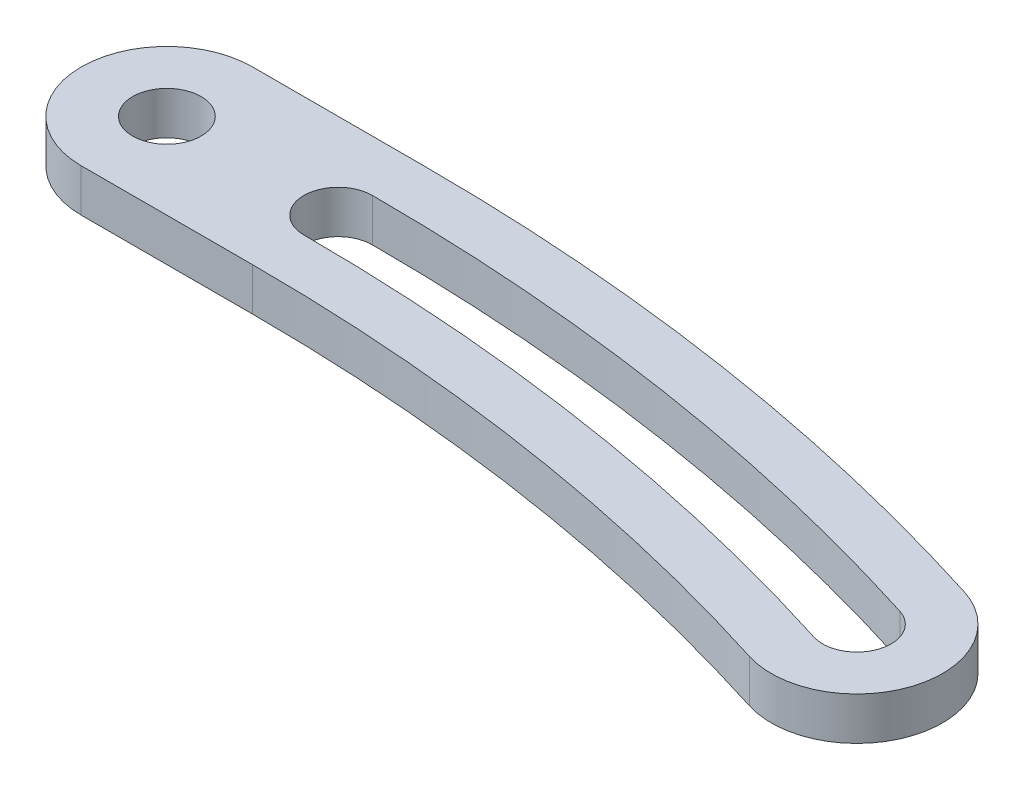
ISO-10303-21;
HEADER;
FILE_DESCRIPTION(('STEP AP214'),'2;1');
FILE_NAME('part.step','',(''),(''),'','','');
FILE_SCHEMA(('AUTOMOTIVE_DESIGN { 1 0 10303 214 1 1 1 1 }'));
ENDSEC;
DATA;
#1=APPLICATION_CONTEXT('core data for automotive mechanical design processes');
#2=APPLICATION_PROTOCOL_DEFINITION('international standard','automotive_design',2000,#1);
#3=PRODUCT_CONTEXT('',#1,'mechanical');
#4=PRODUCT('Part','Part','',(#3));
#5=PRODUCT_RELATED_PRODUCT_CATEGORY('part','',(#4));
#6=PRODUCT_DEFINITION_FORMATION('','',#4);
#7=PRODUCT_DEFINITION_CONTEXT('part definition',#1,'design');
#8=PRODUCT_DEFINITION('design','',#6,#7);
#9=PRODUCT_DEFINITION_SHAPE('','',#8);
#10=(LENGTH_UNIT() NAMED_UNIT(*) SI_UNIT(.MILLI.,.METRE.));
#11=(NAMED_UNIT(*) PLANE_ANGLE_UNIT() SI_UNIT($,.RADIAN.));
#12=(NAMED_UNIT(*) SI_UNIT($,.STERADIAN.) SOLID_ANGLE_UNIT());
#13=UNCERTAINTY_MEASURE_WITH_UNIT(LENGTH_MEASURE(1.E-05),#10,'distance_accuracy_value','');
#14=(GEOMETRIC_REPRESENTATION_CONTEXT(3) GLOBAL_UNCERTAINTY_ASSIGNED_CONTEXT((#13)) GLOBAL_UNIT_ASSIGNED_CONTEXT((#10,
#11,#12)) REPRESENTATION_CONTEXT('',''));
#15=CARTESIAN_POINT('',(0.,0.,0.));
#16=DIRECTION('',(0.,0.,1.));
#17=DIRECTION('',(1.,0.,0.));
#18=AXIS2_PLACEMENT_3D('',#15,#16,#17);
#19=CARTESIAN_POINT('',(3.02848265840421E-13,2.,95.));
#20=DIRECTION('',(0.,1.,0.));
#21=DIRECTION('',(0.,0.,1.));
#22=AXIS2_PLACEMENT_3D('',#19,#20,#21);
#23=PLANE('',#22);
#24=CARTESIAN_POINT('',(3.02848265840421E-13,2.,95.));
#25=DIRECTION('',(0.,1.,0.));
#26=DIRECTION('',(0.,0.,1.));
#27=AXIS2_PLACEMENT_3D('',#24,#25,#26);
#28=CIRCLE('',#27,96.6);
#29=CARTESIAN_POINT('',(29.1429098930937,2.,2.90086426592787));
#30=VERTEX_POINT('',#29);
#31=CARTESIAN_POINT('',(0.,2.,-1.60000000000002));
#32=VERTEX_POINT('',#31);
#33=EDGE_CURVE('E121',#30,#32,#28,.T.);
#34=ORIENTED_EDGE('',*,*,#33,.F.);
#35=CARTESIAN_POINT('',(28.660211592587,2.,4.42631578947359));
#36=DIRECTION('',(0.,1.,0.));
#37=DIRECTION('',(0.,0.,1.));
#38=AXIS2_PLACEMENT_3D('',#35,#36,#37);
#39=CIRCLE('',#38,1.60000000000001);
#40=CARTESIAN_POINT('',(28.1775132920802,2.,5.95176731301932));
#41=VERTEX_POINT('',#40);
#42=EDGE_CURVE('E113',#41,#30,#39,.T.);
#43=ORIENTED_EDGE('',*,*,#42,.F.);
#44=CARTESIAN_POINT('',(3.02848265840421E-13,2.,95.));
#45=DIRECTION('',(0.,-1.,0.));
#46=DIRECTION('',(0.,0.,1.));
#47=AXIS2_PLACEMENT_3D('',#44,#45,#46);
#48=CIRCLE('',#47,93.4);
#49=CARTESIAN_POINT('',(0.,2.,1.60000000000002));
#50=VERTEX_POINT('',#49);
#51=EDGE_CURVE('E136',#50,#41,#48,.T.);
#52=ORIENTED_EDGE('',*,*,#51,.F.);
#53=CARTESIAN_POINT('',(0.,2.,0.));
#54=DIRECTION('',(0.,1.,0.));
#55=DIRECTION('',(0.,0.,1.));
#56=AXIS2_PLACEMENT_3D('',#53,#54,#55);
#57=CIRCLE('',#56,1.60000000000001);
#58=EDGE_CURVE('E134',#32,#50,#57,.T.);
#59=ORIENTED_EDGE('',*,*,#58,.F.);
#60=EDGE_LOOP('',(#34,#43,#52,#59));
#61=FACE_BOUND('',#60,.T.);
#62=CARTESIAN_POINT('',(3.02848265840421E-13,2.,95.));
#63=DIRECTION('',(0.,-1.,0.));
#64=DIRECTION('',(0.,0.,1.));
#65=AXIS2_PLACEMENT_3D('',#62,#63,#64);
#66=CIRCLE('',#65,91.);
#67=CARTESIAN_POINT('',(0.,2.,4.00000000000002));
#68=VERTEX_POINT('',#67);
#69=CARTESIAN_POINT('',(27.4534658413202,2.,8.23994459833787));
#70=VERTEX_POINT('',#69);
#71=EDGE_CURVE('E152',#68,#70,#66,.T.);
#72=ORIENTED_EDGE('',*,*,#71,.T.);
#73=CARTESIAN_POINT('',(28.660211592587,2.,4.42631578947359));
#74=DIRECTION('',(0.,1.,0.));
#75=DIRECTION('',(0.,0.,1.));
#76=AXIS2_PLACEMENT_3D('',#73,#74,#75);
#77=CIRCLE('',#76,4.00000000000001);
#78=CARTESIAN_POINT('',(29.8669573438538,2.,0.612686980609317));
#79=VERTEX_POINT('',#78);
#80=EDGE_CURVE('E155',#70,#79,#77,.T.);
#81=ORIENTED_EDGE('',*,*,#80,.T.);
#82=CARTESIAN_POINT('',(3.02848265840421E-13,2.,95.));
#83=DIRECTION('',(0.,1.,0.));
#84=DIRECTION('',(0.,0.,-1.));
#85=AXIS2_PLACEMENT_3D('',#82,#83,#84);
#86=CIRCLE('',#85,99.);
#87=CARTESIAN_POINT('',(2.78443446685012E-13,2.,-4.00000000000002));
#88=VERTEX_POINT('',#87);
#89=EDGE_CURVE('E158',#79,#88,#86,.T.);
#90=ORIENTED_EDGE('',*,*,#89,.T.);
#91=DIRECTION('',(-1.,0.,0.));
#92=VECTOR('',#91,1.);
#93=CARTESIAN_POINT('',(-8.,2.,-4.00000000000001));
#94=LINE('',#93,#92);
#95=CARTESIAN_POINT('',(-8.,2.,-4.00000000000001));
#96=VERTEX_POINT('',#95);
#97=EDGE_CURVE('E160',#88,#96,#94,.T.);
#98=ORIENTED_EDGE('',*,*,#97,.T.);
#99=CARTESIAN_POINT('',(-8.,2.,0.));
#100=DIRECTION('',(0.,1.,0.));
#101=DIRECTION('',(0.,0.,1.));
#102=AXIS2_PLACEMENT_3D('',#99,#100,#101);
#103=CIRCLE('',#102,4.00000000000001);
#104=CARTESIAN_POINT('',(-8.,2.,4.));
#105=VERTEX_POINT('',#104);
#106=EDGE_CURVE('E162',#96,#105,#103,.T.);
#107=ORIENTED_EDGE('',*,*,#106,.T.);
#108=DIRECTION('',(1.,0.,0.));
#109=VECTOR('',#108,1.);
#110=CARTESIAN_POINT('',(-8.,2.,4.));
#111=LINE('',#110,#109);
#112=EDGE_CURVE('E164',#105,#68,#111,.T.);
#113=ORIENTED_EDGE('',*,*,#112,.T.);
#114=EDGE_LOOP('',(#72,#81,#90,#98,#107,#113));
#115=FACE_BOUND('',#114,.T.);
#116=CARTESIAN_POINT('',(-8.,2.,0.));
#117=DIRECTION('',(0.,1.,0.));
#118=DIRECTION('',(0.,0.,1.));
#119=AXIS2_PLACEMENT_3D('',#116,#117,#118);
#120=CIRCLE('',#119,1.59999999999999);
#121=CARTESIAN_POINT('',(-8.,2.,1.6));
#122=VERTEX_POINT('',#121);
#123=EDGE_CURVE('E142',#122,#122,#120,.T.);
#124=ORIENTED_EDGE('',*,*,#123,.F.);
#125=EDGE_LOOP('',(#124));
#126=FACE_BOUND('',#125,.T.);
#127=ADVANCED_FACE('F36',(#61,#115,#126),#23,.T.);
#128=CARTESIAN_POINT('',(3.02848265840421E-13,0.,95.));
#129=DIRECTION('',(0.,1.,0.));
#130=DIRECTION('',(0.,0.,1.));
#131=AXIS2_PLACEMENT_3D('',#128,#129,#130);
#132=PLANE('',#131);
#133=CARTESIAN_POINT('',(3.02848265840421E-13,0.,95.));
#134=DIRECTION('',(0.,-1.,0.));
#135=DIRECTION('',(0.,0.,1.));
#136=AXIS2_PLACEMENT_3D('',#133,#134,#135);
#137=CIRCLE('',#136,91.);
#138=CARTESIAN_POINT('',(0.,0.,4.00000000000002));
#139=VERTEX_POINT('',#138);
#140=CARTESIAN_POINT('',(27.4534658413202,0.,8.23994459833787));
#141=VERTEX_POINT('',#140);
#142=EDGE_CURVE('E129',#139,#141,#137,.T.);
#143=ORIENTED_EDGE('',*,*,#142,.F.);
#144=DIRECTION('',(1.,0.,0.));
#145=VECTOR('',#144,1.);
#146=CARTESIAN_POINT('',(-8.,0.,4.));
#147=LINE('',#146,#145);
#148=CARTESIAN_POINT('',(-8.,0.,4.));
#149=VERTEX_POINT('',#148);
#150=EDGE_CURVE('E156',#149,#139,#147,.T.);
#151=ORIENTED_EDGE('',*,*,#150,.F.);
#152=CARTESIAN_POINT('',(-8.,0.,0.));
#153=DIRECTION('',(0.,1.,0.));
#154=DIRECTION('',(0.,0.,1.));
#155=AXIS2_PLACEMENT_3D('',#152,#153,#154);
#156=CIRCLE('',#155,4.00000000000001);
#157=CARTESIAN_POINT('',(-8.,0.,-4.00000000000001));
#158=VERTEX_POINT('',#157);
#159=EDGE_CURVE('E175',#158,#149,#156,.T.);
#160=ORIENTED_EDGE('',*,*,#159,.F.);
#161=DIRECTION('',(-1.,0.,0.));
#162=VECTOR('',#161,1.);
#163=CARTESIAN_POINT('',(-8.,0.,-4.00000000000001));
#164=LINE('',#163,#162);
#165=CARTESIAN_POINT('',(2.78443446685012E-13,0.,-4.00000000000002));
#166=VERTEX_POINT('',#165);
#167=EDGE_CURVE('E173',#166,#158,#164,.T.);
#168=ORIENTED_EDGE('',*,*,#167,.F.);
#169=CARTESIAN_POINT('',(3.02848265840421E-13,0.,95.));
#170=DIRECTION('',(0.,1.,0.));
#171=DIRECTION('',(0.,0.,-1.));
#172=AXIS2_PLACEMENT_3D('',#169,#170,#171);
#173=CIRCLE('',#172,99.);
#174=CARTESIAN_POINT('',(29.8669573438538,0.,0.612686980609317));
#175=VERTEX_POINT('',#174);
#176=EDGE_CURVE('E171',#175,#166,#173,.T.);
#177=ORIENTED_EDGE('',*,*,#176,.F.);
#178=CARTESIAN_POINT('',(28.660211592587,0.,4.42631578947359));
#179=DIRECTION('',(0.,1.,0.));
#180=DIRECTION('',(0.,0.,1.));
#181=AXIS2_PLACEMENT_3D('',#178,#179,#180);
#182=CIRCLE('',#181,4.00000000000001);
#183=EDGE_CURVE('E169',#141,#175,#182,.T.);
#184=ORIENTED_EDGE('',*,*,#183,.F.);
#185=EDGE_LOOP('',(#143,#151,#160,#168,#177,#184));
#186=FACE_BOUND('',#185,.T.);
#187=CARTESIAN_POINT('',(28.660211592587,0.,4.42631578947359));
#188=DIRECTION('',(0.,1.,0.));
#189=DIRECTION('',(0.,0.,1.));
#190=AXIS2_PLACEMENT_3D('',#187,#188,#189);
#191=CIRCLE('',#190,1.60000000000001);
#192=CARTESIAN_POINT('',(28.1775132920803,0.,5.95176731301932));
#193=VERTEX_POINT('',#192);
#194=CARTESIAN_POINT('',(29.1429098930937,0.,2.90086426592787));
#195=VERTEX_POINT('',#194);
#196=EDGE_CURVE('E59',#193,#195,#191,.T.);
#197=ORIENTED_EDGE('',*,*,#196,.T.);
#198=CARTESIAN_POINT('',(3.02848265840421E-13,0.,95.));
#199=DIRECTION('',(0.,1.,0.));
#200=DIRECTION('',(0.,0.,1.));
#201=AXIS2_PLACEMENT_3D('',#198,#199,#200);
#202=CIRCLE('',#201,96.6);
#203=CARTESIAN_POINT('',(0.,0.,-1.60000000000002));
#204=VERTEX_POINT('',#203);
#205=EDGE_CURVE('E128',#195,#204,#202,.T.);
#206=ORIENTED_EDGE('',*,*,#205,.T.);
#207=CARTESIAN_POINT('',(0.,0.,0.));
#208=DIRECTION('',(0.,1.,0.));
#209=DIRECTION('',(0.,0.,1.));
#210=AXIS2_PLACEMENT_3D('',#207,#208,#209);
#211=CIRCLE('',#210,1.60000000000001);
#212=CARTESIAN_POINT('',(0.,0.,1.60000000000001));
#213=VERTEX_POINT('',#212);
#214=EDGE_CURVE('E144',#204,#213,#211,.T.);
#215=ORIENTED_EDGE('',*,*,#214,.T.);
#216=CARTESIAN_POINT('',(3.02848265840421E-13,0.,95.));
#217=DIRECTION('',(0.,-1.,0.));
#218=DIRECTION('',(0.,0.,1.));
#219=AXIS2_PLACEMENT_3D('',#216,#217,#218);
#220=CIRCLE('',#219,93.4);
#221=EDGE_CURVE('E122',#213,#193,#220,.T.);
#222=ORIENTED_EDGE('',*,*,#221,.T.);
#223=EDGE_LOOP('',(#197,#206,#215,#222));
#224=FACE_BOUND('',#223,.T.);
#225=CARTESIAN_POINT('',(-8.,0.,0.));
#226=DIRECTION('',(0.,1.,0.));
#227=DIRECTION('',(0.,0.,1.));
#228=AXIS2_PLACEMENT_3D('',#225,#226,#227);
#229=CIRCLE('',#228,1.59999999999999);
#230=CARTESIAN_POINT('',(-8.,0.,1.6));
#231=VERTEX_POINT('',#230);
#232=EDGE_CURVE('E254',#231,#231,#229,.T.);
#233=ORIENTED_EDGE('',*,*,#232,.T.);
#234=EDGE_LOOP('',(#233));
#235=FACE_BOUND('',#234,.T.);
#236=ADVANCED_FACE('F199',(#186,#224,#235),#132,.F.);
#237=CARTESIAN_POINT('',(3.02848265840421E-13,2.,95.));
#238=DIRECTION('',(0.,-1.,0.));
#239=DIRECTION('',(0.,0.,-1.));
#240=AXIS2_PLACEMENT_3D('',#237,#238,#239);
#241=CYLINDRICAL_SURFACE('',#240,91.);
#242=ORIENTED_EDGE('',*,*,#142,.T.);
#243=DIRECTION('',(0.,-1.,0.));
#244=VECTOR('',#243,1.);
#245=CARTESIAN_POINT('',(27.4534658413202,2.,8.23994459833787));
#246=LINE('',#245,#244);
#247=EDGE_CURVE('E11',#70,#141,#246,.T.);
#248=ORIENTED_EDGE('',*,*,#247,.F.);
#249=ORIENTED_EDGE('',*,*,#71,.F.);
#250=DIRECTION('',(0.,-1.,0.));
#251=VECTOR('',#250,1.);
#252=CARTESIAN_POINT('',(0.,2.,4.00000000000002));
#253=LINE('',#252,#251);
#254=EDGE_CURVE('E166',#68,#139,#253,.T.);
#255=ORIENTED_EDGE('',*,*,#254,.T.);
#256=EDGE_LOOP('',(#242,#248,#249,#255));
#257=FACE_BOUND('',#256,.T.);
#258=ADVANCED_FACE('F38',(#257),#241,.F.);
#259=CARTESIAN_POINT('',(28.660211592587,2.,4.42631578947359));
#260=DIRECTION('',(0.,-1.,0.));
#261=DIRECTION('',(0.,0.,-1.));
#262=AXIS2_PLACEMENT_3D('',#259,#260,#261);
#263=CYLINDRICAL_SURFACE('',#262,4.00000000000001);
#264=ORIENTED_EDGE('',*,*,#183,.T.);
#265=DIRECTION('',(0.,-1.,0.));
#266=VECTOR('',#265,1.);
#267=CARTESIAN_POINT('',(29.8669573438538,2.,0.612686980609317));
#268=LINE('',#267,#266);
#269=EDGE_CURVE('E44',#79,#175,#268,.T.);
#270=ORIENTED_EDGE('',*,*,#269,.F.);
#271=ORIENTED_EDGE('',*,*,#80,.F.);
#272=ORIENTED_EDGE('',*,*,#247,.T.);
#273=EDGE_LOOP('',(#264,#270,#271,#272));
#274=FACE_BOUND('',#273,.T.);
#275=ADVANCED_FACE('F216',(#274),#263,.T.);
#276=CARTESIAN_POINT('',(3.02848265840421E-13,2.,95.));
#277=DIRECTION('',(0.,-1.,0.));
#278=DIRECTION('',(0.,0.,-1.));
#279=AXIS2_PLACEMENT_3D('',#276,#277,#278);
#280=CYLINDRICAL_SURFACE('',#279,99.);
#281=ORIENTED_EDGE('',*,*,#176,.T.);
#282=DIRECTION('',(0.,-1.,0.));
#283=VECTOR('',#282,1.);
#284=CARTESIAN_POINT('',(2.78443446685012E-13,2.,-4.00000000000002));
#285=LINE('',#284,#283);
#286=EDGE_CURVE('E186',#88,#166,#285,.T.);
#287=ORIENTED_EDGE('',*,*,#286,.F.);
#288=ORIENTED_EDGE('',*,*,#89,.F.);
#289=ORIENTED_EDGE('',*,*,#269,.T.);
#290=EDGE_LOOP('',(#281,#287,#288,#289));
#291=FACE_BOUND('',#290,.T.);
#292=ADVANCED_FACE('F193',(#291),#280,.T.);
#293=CARTESIAN_POINT('',(-8.,2.,-4.00000000000001));
#294=DIRECTION('',(0.,0.,1.));
#295=DIRECTION('',(1.,0.,0.));
#296=AXIS2_PLACEMENT_3D('',#293,#294,#295);
#297=PLANE('',#296);
#298=ORIENTED_EDGE('',*,*,#167,.T.);
#299=DIRECTION('',(0.,-1.,0.));
#300=VECTOR('',#299,1.);
#301=CARTESIAN_POINT('',(-8.,2.,-4.00000000000001));
#302=LINE('',#301,#300);
#303=EDGE_CURVE('E183',#96,#158,#302,.T.);
#304=ORIENTED_EDGE('',*,*,#303,.F.);
#305=ORIENTED_EDGE('',*,*,#97,.F.);
#306=ORIENTED_EDGE('',*,*,#286,.T.);
#307=EDGE_LOOP('',(#298,#304,#305,#306));
#308=FACE_BOUND('',#307,.T.);
#309=ADVANCED_FACE('F205',(#308),#297,.F.);
#310=CARTESIAN_POINT('',(-8.,2.,0.));
#311=DIRECTION('',(0.,-1.,0.));
#312=DIRECTION('',(0.,0.,-1.));
#313=AXIS2_PLACEMENT_3D('',#310,#311,#312);
#314=CYLINDRICAL_SURFACE('',#313,4.00000000000001);
#315=ORIENTED_EDGE('',*,*,#159,.T.);
#316=DIRECTION('',(0.,-1.,0.));
#317=VECTOR('',#316,1.);
#318=CARTESIAN_POINT('',(-8.,2.,4.));
#319=LINE('',#318,#317);
#320=EDGE_CURVE('E180',#105,#149,#319,.T.);
#321=ORIENTED_EDGE('',*,*,#320,.F.);
#322=ORIENTED_EDGE('',*,*,#106,.F.);
#323=ORIENTED_EDGE('',*,*,#303,.T.);
#324=EDGE_LOOP('',(#315,#321,#322,#323));
#325=FACE_BOUND('',#324,.T.);
#326=ADVANCED_FACE('F209',(#325),#314,.T.);
#327=CARTESIAN_POINT('',(-8.,2.,4.));
#328=DIRECTION('',(0.,0.,-1.));
#329=DIRECTION('',(-1.,0.,0.));
#330=AXIS2_PLACEMENT_3D('',#327,#328,#329);
#331=PLANE('',#330);
#332=ORIENTED_EDGE('',*,*,#150,.T.);
#333=ORIENTED_EDGE('',*,*,#254,.F.);
#334=ORIENTED_EDGE('',*,*,#112,.F.);
#335=ORIENTED_EDGE('',*,*,#320,.T.);
#336=EDGE_LOOP('',(#332,#333,#334,#335));
#337=FACE_BOUND('',#336,.T.);
#338=ADVANCED_FACE('F219',(#337),#331,.F.);
#339=CARTESIAN_POINT('',(28.660211592587,2.,4.42631578947359));
#340=DIRECTION('',(0.,-1.,0.));
#341=DIRECTION('',(0.,0.,-1.));
#342=AXIS2_PLACEMENT_3D('',#339,#340,#341);
#343=CYLINDRICAL_SURFACE('',#342,1.60000000000001);
#344=ORIENTED_EDGE('',*,*,#196,.F.);
#345=DIRECTION('',(0.,-1.,0.));
#346=VECTOR('',#345,1.);
#347=CARTESIAN_POINT('',(28.1775132920802,2.,5.95176731301932));
#348=LINE('',#347,#346);
#349=EDGE_CURVE('E117',#41,#193,#348,.T.);
#350=ORIENTED_EDGE('',*,*,#349,.F.);
#351=ORIENTED_EDGE('',*,*,#42,.T.);
#352=DIRECTION('',(0.,-1.,0.));
#353=VECTOR('',#352,1.);
#354=CARTESIAN_POINT('',(29.1429098930937,2.,2.90086426592787));
#355=LINE('',#354,#353);
#356=EDGE_CURVE('E116',#30,#195,#355,.T.);
#357=ORIENTED_EDGE('',*,*,#356,.T.);
#358=EDGE_LOOP('',(#344,#350,#351,#357));
#359=FACE_BOUND('',#358,.T.);
#360=ADVANCED_FACE('F115',(#359),#343,.F.);
#361=CARTESIAN_POINT('',(3.02848265840421E-13,2.,95.));
#362=DIRECTION('',(0.,-1.,0.));
#363=DIRECTION('',(0.,0.,-1.));
#364=AXIS2_PLACEMENT_3D('',#361,#362,#363);
#365=CYLINDRICAL_SURFACE('',#364,96.6);
#366=ORIENTED_EDGE('',*,*,#205,.F.);
#367=ORIENTED_EDGE('',*,*,#356,.F.);
#368=ORIENTED_EDGE('',*,*,#33,.T.);
#369=DIRECTION('',(0.,-1.,0.));
#370=VECTOR('',#369,1.);
#371=CARTESIAN_POINT('',(0.,2.,-1.60000000000002));
#372=LINE('',#371,#370);
#373=EDGE_CURVE('E130',#32,#204,#372,.T.);
#374=ORIENTED_EDGE('',*,*,#373,.T.);
#375=EDGE_LOOP('',(#366,#367,#368,#374));
#376=FACE_BOUND('',#375,.T.);
#377=ADVANCED_FACE('F125',(#376),#365,.F.);
#378=CARTESIAN_POINT('',(0.,2.,0.));
#379=DIRECTION('',(0.,-1.,0.));
#380=DIRECTION('',(0.,0.,-1.));
#381=AXIS2_PLACEMENT_3D('',#378,#379,#380);
#382=CYLINDRICAL_SURFACE('',#381,1.60000000000001);
#383=ORIENTED_EDGE('',*,*,#214,.F.);
#384=ORIENTED_EDGE('',*,*,#373,.F.);
#385=ORIENTED_EDGE('',*,*,#58,.T.);
#386=DIRECTION('',(0.,-1.,0.));
#387=VECTOR('',#386,1.);
#388=CARTESIAN_POINT('',(0.,2.,1.60000000000001));
#389=LINE('',#388,#387);
#390=EDGE_CURVE('E51',#50,#213,#389,.T.);
#391=ORIENTED_EDGE('',*,*,#390,.T.);
#392=EDGE_LOOP('',(#383,#384,#385,#391));
#393=FACE_BOUND('',#392,.T.);
#394=ADVANCED_FACE('F237',(#393),#382,.F.);
#395=CARTESIAN_POINT('',(3.02848265840421E-13,2.,95.));
#396=DIRECTION('',(0.,-1.,0.));
#397=DIRECTION('',(0.,0.,-1.));
#398=AXIS2_PLACEMENT_3D('',#395,#396,#397);
#399=CYLINDRICAL_SURFACE('',#398,93.4);
#400=ORIENTED_EDGE('',*,*,#221,.F.);
#401=ORIENTED_EDGE('',*,*,#390,.F.);
#402=ORIENTED_EDGE('',*,*,#51,.T.);
#403=ORIENTED_EDGE('',*,*,#349,.T.);
#404=EDGE_LOOP('',(#400,#401,#402,#403));
#405=FACE_BOUND('',#404,.T.);
#406=ADVANCED_FACE('F240',(#405),#399,.T.);
#407=CARTESIAN_POINT('',(-8.,2.,0.));
#408=DIRECTION('',(0.,-1.,0.));
#409=DIRECTION('',(0.,0.,-1.));
#410=AXIS2_PLACEMENT_3D('',#407,#408,#409);
#411=CYLINDRICAL_SURFACE('',#410,1.59999999999999);
#412=ORIENTED_EDGE('',*,*,#123,.T.);
#413=EDGE_LOOP('',(#412));
#414=FACE_BOUND('',#413,.T.);
#415=ORIENTED_EDGE('',*,*,#232,.F.);
#416=EDGE_LOOP('',(#415));
#417=FACE_BOUND('',#416,.T.);
#418=ADVANCED_FACE('F244',(#414,#417),#411,.F.);
#419=CLOSED_SHELL('',(#127,#236,#258,#275,#292,#309,#326,#338,#360,#377,#394,#406,#418));
#420=MANIFOLD_SOLID_BREP('B2',#419);
#421=ADVANCED_BREP_SHAPE_REPRESENTATION('',(#18,#420),#14);
#422=SHAPE_DEFINITION_REPRESENTATION(#9,#421);
ENDSEC;
END-ISO-10303-21;
